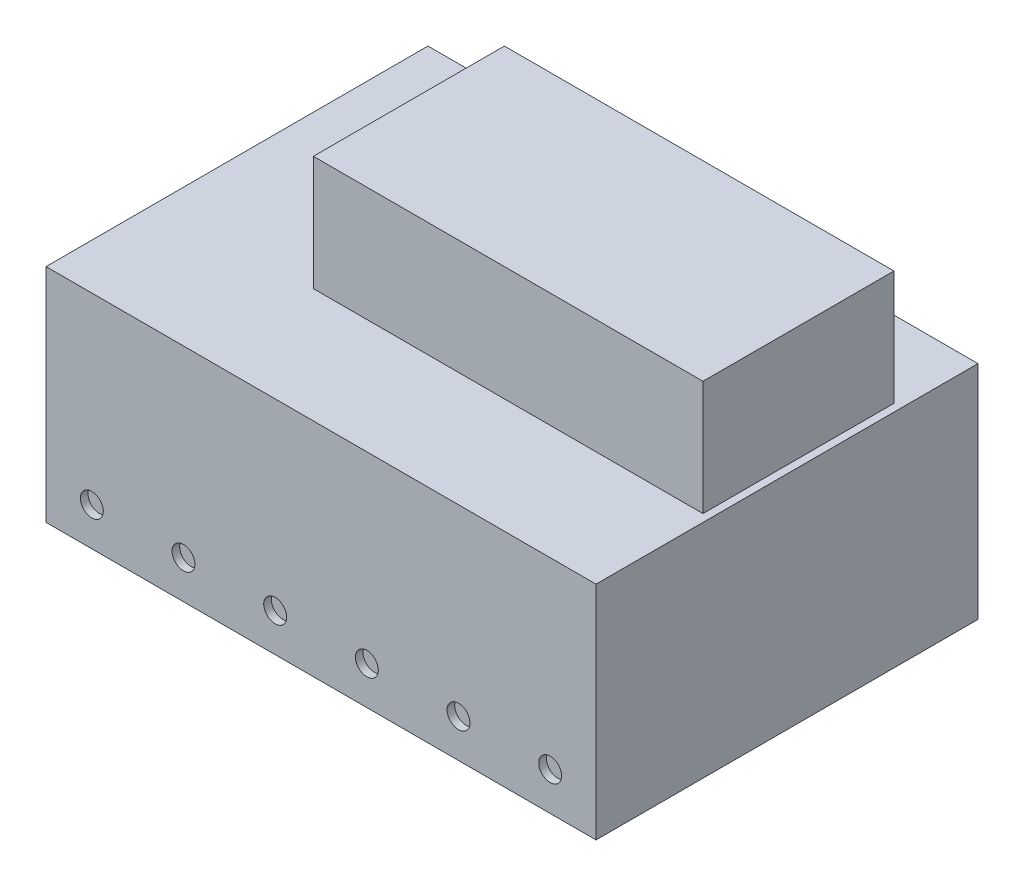
ISO-10303-21;
HEADER;
FILE_DESCRIPTION(('STEP AP214'),'2;1');
FILE_NAME('part.step','',(''),(''),'','','');
FILE_SCHEMA(('AUTOMOTIVE_DESIGN { 1 0 10303 214 1 1 1 1 }'));
ENDSEC;
DATA;
#1=APPLICATION_CONTEXT('core data for automotive mechanical design processes');
#2=APPLICATION_PROTOCOL_DEFINITION('international standard','automotive_design',2000,#1);
#3=PRODUCT_CONTEXT('',#1,'mechanical');
#4=PRODUCT('Part','Part','',(#3));
#5=PRODUCT_RELATED_PRODUCT_CATEGORY('part','',(#4));
#6=PRODUCT_DEFINITION_FORMATION('','',#4);
#7=PRODUCT_DEFINITION_CONTEXT('part definition',#1,'design');
#8=PRODUCT_DEFINITION('design','',#6,#7);
#9=PRODUCT_DEFINITION_SHAPE('','',#8);
#10=(LENGTH_UNIT() NAMED_UNIT(*) SI_UNIT(.MILLI.,.METRE.));
#11=(NAMED_UNIT(*) PLANE_ANGLE_UNIT() SI_UNIT($,.RADIAN.));
#12=(NAMED_UNIT(*) SI_UNIT($,.STERADIAN.) SOLID_ANGLE_UNIT());
#13=UNCERTAINTY_MEASURE_WITH_UNIT(LENGTH_MEASURE(1.E-05),#10,'distance_accuracy_value','');
#14=(GEOMETRIC_REPRESENTATION_CONTEXT(3) GLOBAL_UNCERTAINTY_ASSIGNED_CONTEXT((#13)) GLOBAL_UNIT_ASSIGNED_CONTEXT((#10,
#11,#12)) REPRESENTATION_CONTEXT('',''));
#15=CARTESIAN_POINT('',(0.,0.,0.));
#16=DIRECTION('',(0.,0.,1.));
#17=DIRECTION('',(1.,0.,0.));
#18=AXIS2_PLACEMENT_3D('',#15,#16,#17);
#19=CARTESIAN_POINT('',(-36.,14.5,50.));
#20=DIRECTION('',(0.,-1.,0.));
#21=DIRECTION('',(0.,0.,-1.));
#22=AXIS2_PLACEMENT_3D('',#19,#20,#21);
#23=PLANE('',#22);
#24=CARTESIAN_POINT('',(26.,14.5,5.));
#25=DIRECTION('',(0.,-1.,0.));
#26=DIRECTION('',(0.,0.,-1.));
#27=AXIS2_PLACEMENT_3D('',#24,#25,#26);
#28=CIRCLE('',#27,2.5);
#29=CARTESIAN_POINT('',(26.,14.5,2.5));
#30=VERTEX_POINT('',#29);
#31=EDGE_CURVE('E283',#30,#30,#28,.F.);
#32=ORIENTED_EDGE('',*,*,#31,.F.);
#33=EDGE_LOOP('',(#32));
#34=FACE_BOUND('',#33,.T.);
#35=CARTESIAN_POINT('',(-26.,14.5,5.));
#36=DIRECTION('',(0.,-1.,0.));
#37=DIRECTION('',(0.,0.,-1.));
#38=AXIS2_PLACEMENT_3D('',#35,#36,#37);
#39=CIRCLE('',#38,2.5);
#40=CARTESIAN_POINT('',(-26.,14.5,2.5));
#41=VERTEX_POINT('',#40);
#42=EDGE_CURVE('E290',#41,#41,#39,.F.);
#43=ORIENTED_EDGE('',*,*,#42,.F.);
#44=EDGE_LOOP('',(#43));
#45=FACE_BOUND('',#44,.T.);
#46=DIRECTION('',(-1.,0.,0.));
#47=VECTOR('',#46,1.);
#48=CARTESIAN_POINT('',(-36.,14.5,0.));
#49=LINE('',#48,#47);
#50=CARTESIAN_POINT('',(36.,14.5,0.));
#51=VERTEX_POINT('',#50);
#52=CARTESIAN_POINT('',(-36.,14.5,0.));
#53=VERTEX_POINT('',#52);
#54=EDGE_CURVE('E133',#51,#53,#49,.T.);
#55=ORIENTED_EDGE('',*,*,#54,.T.);
#56=DIRECTION('',(0.,0.,-1.));
#57=VECTOR('',#56,1.);
#58=CARTESIAN_POINT('',(-36.,14.5,50.));
#59=LINE('',#58,#57);
#60=CARTESIAN_POINT('',(-36.,14.5,50.));
#61=VERTEX_POINT('',#60);
#62=EDGE_CURVE('E48',#61,#53,#59,.T.);
#63=ORIENTED_EDGE('',*,*,#62,.F.);
#64=DIRECTION('',(-1.,0.,0.));
#65=VECTOR('',#64,1.);
#66=CARTESIAN_POINT('',(-36.,14.5,50.));
#67=LINE('',#66,#65);
#68=CARTESIAN_POINT('',(36.,14.5,50.));
#69=VERTEX_POINT('',#68);
#70=EDGE_CURVE('E143',#69,#61,#67,.T.);
#71=ORIENTED_EDGE('',*,*,#70,.F.);
#72=DIRECTION('',(0.,0.,-1.));
#73=VECTOR('',#72,1.);
#74=CARTESIAN_POINT('',(36.,14.5,50.));
#75=LINE('',#74,#73);
#76=EDGE_CURVE('E11',#69,#51,#75,.T.);
#77=ORIENTED_EDGE('',*,*,#76,.T.);
#78=EDGE_LOOP('',(#55,#63,#71,#77));
#79=FACE_BOUND('',#78,.T.);
#80=DIRECTION('',(0.,0.,1.));
#81=VECTOR('',#80,1.);
#82=CARTESIAN_POINT('',(-16.,14.5,10.));
#83=LINE('',#82,#81);
#84=CARTESIAN_POINT('',(-16.,14.5,10.));
#85=VERTEX_POINT('',#84);
#86=CARTESIAN_POINT('',(-16.,14.5,35.));
#87=VERTEX_POINT('',#86);
#88=EDGE_CURVE('E55',#85,#87,#83,.T.);
#89=ORIENTED_EDGE('',*,*,#88,.F.);
#90=DIRECTION('',(-1.,0.,0.));
#91=VECTOR('',#90,1.);
#92=CARTESIAN_POINT('',(-16.,14.5,10.));
#93=LINE('',#92,#91);
#94=CARTESIAN_POINT('',(35.,14.5,10.));
#95=VERTEX_POINT('',#94);
#96=EDGE_CURVE('E59',#95,#85,#93,.T.);
#97=ORIENTED_EDGE('',*,*,#96,.F.);
#98=DIRECTION('',(0.,0.,-1.));
#99=VECTOR('',#98,1.);
#100=CARTESIAN_POINT('',(35.,14.5,10.));
#101=LINE('',#100,#99);
#102=CARTESIAN_POINT('',(35.,14.5,35.));
#103=VERTEX_POINT('',#102);
#104=EDGE_CURVE('E355',#103,#95,#101,.T.);
#105=ORIENTED_EDGE('',*,*,#104,.F.);
#106=DIRECTION('',(1.,0.,0.));
#107=VECTOR('',#106,1.);
#108=CARTESIAN_POINT('',(-16.,14.5,35.));
#109=LINE('',#108,#107);
#110=EDGE_CURVE('E352',#87,#103,#109,.T.);
#111=ORIENTED_EDGE('',*,*,#110,.F.);
#112=EDGE_LOOP('',(#89,#97,#105,#111));
#113=FACE_BOUND('',#112,.T.);
#114=ADVANCED_FACE('F39',(#34,#45,#79,#113),#23,.F.);
#115=CARTESIAN_POINT('',(36.,-14.5,50.));
#116=DIRECTION('',(-1.,0.,0.));
#117=DIRECTION('',(0.,0.,1.));
#118=AXIS2_PLACEMENT_3D('',#115,#116,#117);
#119=PLANE('',#118);
#120=DIRECTION('',(0.,1.,0.));
#121=VECTOR('',#120,1.);
#122=CARTESIAN_POINT('',(36.,-14.5,0.));
#123=LINE('',#122,#121);
#124=CARTESIAN_POINT('',(36.,-14.5,0.));
#125=VERTEX_POINT('',#124);
#126=EDGE_CURVE('E128',#125,#51,#123,.T.);
#127=ORIENTED_EDGE('',*,*,#126,.T.);
#128=ORIENTED_EDGE('',*,*,#76,.F.);
#129=DIRECTION('',(0.,1.,0.));
#130=VECTOR('',#129,1.);
#131=CARTESIAN_POINT('',(36.,-14.5,50.));
#132=LINE('',#131,#130);
#133=CARTESIAN_POINT('',(36.,-14.5,50.));
#134=VERTEX_POINT('',#133);
#135=EDGE_CURVE('E139',#134,#69,#132,.T.);
#136=ORIENTED_EDGE('',*,*,#135,.F.);
#137=DIRECTION('',(0.,0.,-1.));
#138=VECTOR('',#137,1.);
#139=CARTESIAN_POINT('',(36.,-14.5,50.));
#140=LINE('',#139,#138);
#141=EDGE_CURVE('E152',#134,#125,#140,.T.);
#142=ORIENTED_EDGE('',*,*,#141,.T.);
#143=EDGE_LOOP('',(#127,#128,#136,#142));
#144=FACE_BOUND('',#143,.T.);
#145=ADVANCED_FACE('F41',(#144),#119,.F.);
#146=CARTESIAN_POINT('',(-36.,-14.5,50.));
#147=DIRECTION('',(1.,0.,0.));
#148=DIRECTION('',(0.,0.,-1.));
#149=AXIS2_PLACEMENT_3D('',#146,#147,#148);
#150=PLANE('',#149);
#151=DIRECTION('',(0.,-1.,0.));
#152=VECTOR('',#151,1.);
#153=CARTESIAN_POINT('',(-36.,-14.5,0.));
#154=LINE('',#153,#152);
#155=CARTESIAN_POINT('',(-36.,-14.5,0.));
#156=VERTEX_POINT('',#155);
#157=EDGE_CURVE('E156',#53,#156,#154,.T.);
#158=ORIENTED_EDGE('',*,*,#157,.T.);
#159=DIRECTION('',(0.,0.,-1.));
#160=VECTOR('',#159,1.);
#161=CARTESIAN_POINT('',(-36.,-14.5,50.));
#162=LINE('',#161,#160);
#163=CARTESIAN_POINT('',(-36.,-14.5,50.));
#164=VERTEX_POINT('',#163);
#165=EDGE_CURVE('E164',#164,#156,#162,.T.);
#166=ORIENTED_EDGE('',*,*,#165,.F.);
#167=DIRECTION('',(0.,-1.,0.));
#168=VECTOR('',#167,1.);
#169=CARTESIAN_POINT('',(-36.,-14.5,50.));
#170=LINE('',#169,#168);
#171=EDGE_CURVE('E147',#61,#164,#170,.T.);
#172=ORIENTED_EDGE('',*,*,#171,.F.);
#173=ORIENTED_EDGE('',*,*,#62,.T.);
#174=EDGE_LOOP('',(#158,#166,#172,#173));
#175=FACE_BOUND('',#174,.T.);
#176=ADVANCED_FACE('F173',(#175),#150,.F.);
#177=CARTESIAN_POINT('',(-36.,-14.5,50.));
#178=DIRECTION('',(0.,1.,0.));
#179=DIRECTION('',(0.,0.,1.));
#180=AXIS2_PLACEMENT_3D('',#177,#178,#179);
#181=PLANE('',#180);
#182=CARTESIAN_POINT('',(26.,-14.5,5.));
#183=DIRECTION('',(0.,1.,0.));
#184=DIRECTION('',(0.,0.,1.));
#185=AXIS2_PLACEMENT_3D('',#182,#183,#184);
#186=CIRCLE('',#185,2.5);
#187=CARTESIAN_POINT('',(26.,-14.5,7.5));
#188=VERTEX_POINT('',#187);
#189=EDGE_CURVE('E281',#188,#188,#186,.F.);
#190=ORIENTED_EDGE('',*,*,#189,.F.);
#191=EDGE_LOOP('',(#190));
#192=FACE_BOUND('',#191,.T.);
#193=CARTESIAN_POINT('',(-26.,-14.5,5.));
#194=DIRECTION('',(0.,1.,0.));
#195=DIRECTION('',(0.,0.,1.));
#196=AXIS2_PLACEMENT_3D('',#193,#194,#195);
#197=CIRCLE('',#196,2.5);
#198=CARTESIAN_POINT('',(-26.,-14.5,7.5));
#199=VERTEX_POINT('',#198);
#200=EDGE_CURVE('E285',#199,#199,#197,.F.);
#201=ORIENTED_EDGE('',*,*,#200,.F.);
#202=EDGE_LOOP('',(#201));
#203=FACE_BOUND('',#202,.T.);
#204=DIRECTION('',(1.,0.,0.));
#205=VECTOR('',#204,1.);
#206=CARTESIAN_POINT('',(-36.,-14.5,0.));
#207=LINE('',#206,#205);
#208=EDGE_CURVE('E144',#156,#125,#207,.T.);
#209=ORIENTED_EDGE('',*,*,#208,.T.);
#210=ORIENTED_EDGE('',*,*,#141,.F.);
#211=DIRECTION('',(1.,0.,0.));
#212=VECTOR('',#211,1.);
#213=CARTESIAN_POINT('',(-36.,-14.5,50.));
#214=LINE('',#213,#212);
#215=EDGE_CURVE('E150',#164,#134,#214,.T.);
#216=ORIENTED_EDGE('',*,*,#215,.F.);
#217=ORIENTED_EDGE('',*,*,#165,.T.);
#218=EDGE_LOOP('',(#209,#210,#216,#217));
#219=FACE_BOUND('',#218,.T.);
#220=ADVANCED_FACE('F182',(#192,#203,#219),#181,.F.);
#221=CARTESIAN_POINT('',(0.,0.,50.));
#222=DIRECTION('',(0.,0.,-1.));
#223=DIRECTION('',(-1.,0.,0.));
#224=AXIS2_PLACEMENT_3D('',#221,#222,#223);
#225=PLANE('',#224);
#226=CARTESIAN_POINT('',(-30.,-9.5,50.));
#227=DIRECTION('',(0.,0.,1.));
#228=DIRECTION('',(1.,0.,0.));
#229=AXIS2_PLACEMENT_3D('',#226,#227,#228);
#230=CIRCLE('',#229,1.5);
#231=CARTESIAN_POINT('',(-28.5,-9.5,50.));
#232=VERTEX_POINT('',#231);
#233=EDGE_CURVE('E302',#232,#232,#230,.T.);
#234=ORIENTED_EDGE('',*,*,#233,.F.);
#235=EDGE_LOOP('',(#234));
#236=FACE_BOUND('',#235,.T.);
#237=CARTESIAN_POINT('',(-18.,-9.5,50.));
#238=DIRECTION('',(0.,0.,1.));
#239=DIRECTION('',(1.,0.,0.));
#240=AXIS2_PLACEMENT_3D('',#237,#238,#239);
#241=CIRCLE('',#240,1.5);
#242=CARTESIAN_POINT('',(-16.5,-9.5,50.));
#243=VERTEX_POINT('',#242);
#244=EDGE_CURVE('E310',#243,#243,#241,.T.);
#245=ORIENTED_EDGE('',*,*,#244,.F.);
#246=EDGE_LOOP('',(#245));
#247=FACE_BOUND('',#246,.T.);
#248=CARTESIAN_POINT('',(-6.,-9.5,50.));
#249=DIRECTION('',(0.,0.,1.));
#250=DIRECTION('',(1.,0.,0.));
#251=AXIS2_PLACEMENT_3D('',#248,#249,#250);
#252=CIRCLE('',#251,1.5);
#253=CARTESIAN_POINT('',(-4.5,-9.5,50.));
#254=VERTEX_POINT('',#253);
#255=EDGE_CURVE('E318',#254,#254,#252,.T.);
#256=ORIENTED_EDGE('',*,*,#255,.F.);
#257=EDGE_LOOP('',(#256));
#258=FACE_BOUND('',#257,.T.);
#259=CARTESIAN_POINT('',(6.,-9.5,50.));
#260=DIRECTION('',(0.,0.,1.));
#261=DIRECTION('',(1.,0.,0.));
#262=AXIS2_PLACEMENT_3D('',#259,#260,#261);
#263=CIRCLE('',#262,1.5);
#264=CARTESIAN_POINT('',(7.5,-9.5,50.));
#265=VERTEX_POINT('',#264);
#266=EDGE_CURVE('E326',#265,#265,#263,.T.);
#267=ORIENTED_EDGE('',*,*,#266,.F.);
#268=EDGE_LOOP('',(#267));
#269=FACE_BOUND('',#268,.T.);
#270=CARTESIAN_POINT('',(18.,-9.5,50.));
#271=DIRECTION('',(0.,0.,1.));
#272=DIRECTION('',(1.,0.,0.));
#273=AXIS2_PLACEMENT_3D('',#270,#271,#272);
#274=CIRCLE('',#273,1.5);
#275=CARTESIAN_POINT('',(19.5,-9.5,50.));
#276=VERTEX_POINT('',#275);
#277=EDGE_CURVE('E334',#276,#276,#274,.T.);
#278=ORIENTED_EDGE('',*,*,#277,.F.);
#279=EDGE_LOOP('',(#278));
#280=FACE_BOUND('',#279,.T.);
#281=CARTESIAN_POINT('',(30.,-9.5,50.));
#282=DIRECTION('',(0.,0.,1.));
#283=DIRECTION('',(1.,0.,0.));
#284=AXIS2_PLACEMENT_3D('',#281,#282,#283);
#285=CIRCLE('',#284,1.5);
#286=CARTESIAN_POINT('',(31.5,-9.5,50.));
#287=VERTEX_POINT('',#286);
#288=EDGE_CURVE('E297',#287,#287,#285,.T.);
#289=ORIENTED_EDGE('',*,*,#288,.F.);
#290=EDGE_LOOP('',(#289));
#291=FACE_BOUND('',#290,.T.);
#292=ORIENTED_EDGE('',*,*,#135,.T.);
#293=ORIENTED_EDGE('',*,*,#70,.T.);
#294=ORIENTED_EDGE('',*,*,#171,.T.);
#295=ORIENTED_EDGE('',*,*,#215,.T.);
#296=EDGE_LOOP('',(#292,#293,#294,#295));
#297=FACE_BOUND('',#296,.T.);
#298=ADVANCED_FACE('F188',(#236,#247,#258,#269,#280,#291,#297),#225,.F.);
#299=CARTESIAN_POINT('',(0.,0.,0.));
#300=DIRECTION('',(0.,0.,-1.));
#301=DIRECTION('',(-1.,0.,0.));
#302=AXIS2_PLACEMENT_3D('',#299,#300,#301);
#303=PLANE('',#302);
#304=ORIENTED_EDGE('',*,*,#126,.F.);
#305=ORIENTED_EDGE('',*,*,#208,.F.);
#306=ORIENTED_EDGE('',*,*,#157,.F.);
#307=ORIENTED_EDGE('',*,*,#54,.F.);
#308=EDGE_LOOP('',(#304,#305,#306,#307));
#309=FACE_BOUND('',#308,.T.);
#310=ADVANCED_FACE('F179',(#309),#303,.T.);
#311=CARTESIAN_POINT('',(-16.,29.5,10.));
#312=DIRECTION('',(1.,0.,0.));
#313=DIRECTION('',(0.,0.,-1.));
#314=AXIS2_PLACEMENT_3D('',#311,#312,#313);
#315=PLANE('',#314);
#316=ORIENTED_EDGE('',*,*,#88,.T.);
#317=DIRECTION('',(0.,-1.,0.));
#318=VECTOR('',#317,1.);
#319=CARTESIAN_POINT('',(-16.,29.5,35.));
#320=LINE('',#319,#318);
#321=CARTESIAN_POINT('',(-16.,29.5,35.));
#322=VERTEX_POINT('',#321);
#323=EDGE_CURVE('E108',#322,#87,#320,.T.);
#324=ORIENTED_EDGE('',*,*,#323,.F.);
#325=DIRECTION('',(0.,0.,1.));
#326=VECTOR('',#325,1.);
#327=CARTESIAN_POINT('',(-16.,29.5,10.));
#328=LINE('',#327,#326);
#329=CARTESIAN_POINT('',(-16.,29.5,10.));
#330=VERTEX_POINT('',#329);
#331=EDGE_CURVE('E115',#330,#322,#328,.T.);
#332=ORIENTED_EDGE('',*,*,#331,.F.);
#333=DIRECTION('',(0.,-1.,0.));
#334=VECTOR('',#333,1.);
#335=CARTESIAN_POINT('',(-16.,29.5,10.));
#336=LINE('',#335,#334);
#337=EDGE_CURVE('E349',#330,#85,#336,.T.);
#338=ORIENTED_EDGE('',*,*,#337,.T.);
#339=EDGE_LOOP('',(#316,#324,#332,#338));
#340=FACE_BOUND('',#339,.T.);
#341=ADVANCED_FACE('F126',(#340),#315,.F.);
#342=CARTESIAN_POINT('',(-16.,29.5,35.));
#343=DIRECTION('',(0.,0.,-1.));
#344=DIRECTION('',(-1.,0.,0.));
#345=AXIS2_PLACEMENT_3D('',#342,#343,#344);
#346=PLANE('',#345);
#347=ORIENTED_EDGE('',*,*,#110,.T.);
#348=DIRECTION('',(0.,-1.,0.));
#349=VECTOR('',#348,1.);
#350=CARTESIAN_POINT('',(35.,29.5,35.));
#351=LINE('',#350,#349);
#352=CARTESIAN_POINT('',(35.,29.5,35.));
#353=VERTEX_POINT('',#352);
#354=EDGE_CURVE('E110',#353,#103,#351,.T.);
#355=ORIENTED_EDGE('',*,*,#354,.F.);
#356=DIRECTION('',(1.,0.,0.));
#357=VECTOR('',#356,1.);
#358=CARTESIAN_POINT('',(-16.,29.5,35.));
#359=LINE('',#358,#357);
#360=EDGE_CURVE('E103',#322,#353,#359,.T.);
#361=ORIENTED_EDGE('',*,*,#360,.F.);
#362=ORIENTED_EDGE('',*,*,#323,.T.);
#363=EDGE_LOOP('',(#347,#355,#361,#362));
#364=FACE_BOUND('',#363,.T.);
#365=ADVANCED_FACE('F106',(#364),#346,.F.);
#366=CARTESIAN_POINT('',(35.,29.5,10.));
#367=DIRECTION('',(-1.,0.,0.));
#368=DIRECTION('',(0.,0.,1.));
#369=AXIS2_PLACEMENT_3D('',#366,#367,#368);
#370=PLANE('',#369);
#371=ORIENTED_EDGE('',*,*,#104,.T.);
#372=DIRECTION('',(0.,-1.,0.));
#373=VECTOR('',#372,1.);
#374=CARTESIAN_POINT('',(35.,29.5,10.));
#375=LINE('',#374,#373);
#376=CARTESIAN_POINT('',(35.,29.5,10.));
#377=VERTEX_POINT('',#376);
#378=EDGE_CURVE('E135',#377,#95,#375,.T.);
#379=ORIENTED_EDGE('',*,*,#378,.F.);
#380=DIRECTION('',(0.,0.,-1.));
#381=VECTOR('',#380,1.);
#382=CARTESIAN_POINT('',(35.,29.5,10.));
#383=LINE('',#382,#381);
#384=EDGE_CURVE('E114',#353,#377,#383,.T.);
#385=ORIENTED_EDGE('',*,*,#384,.F.);
#386=ORIENTED_EDGE('',*,*,#354,.T.);
#387=EDGE_LOOP('',(#371,#379,#385,#386));
#388=FACE_BOUND('',#387,.T.);
#389=ADVANCED_FACE('F211',(#388),#370,.F.);
#390=CARTESIAN_POINT('',(-16.,29.5,10.));
#391=DIRECTION('',(0.,0.,1.));
#392=DIRECTION('',(1.,0.,0.));
#393=AXIS2_PLACEMENT_3D('',#390,#391,#392);
#394=PLANE('',#393);
#395=ORIENTED_EDGE('',*,*,#96,.T.);
#396=ORIENTED_EDGE('',*,*,#337,.F.);
#397=DIRECTION('',(-1.,0.,0.));
#398=VECTOR('',#397,1.);
#399=CARTESIAN_POINT('',(-16.,29.5,10.));
#400=LINE('',#399,#398);
#401=EDGE_CURVE('E120',#377,#330,#400,.T.);
#402=ORIENTED_EDGE('',*,*,#401,.F.);
#403=ORIENTED_EDGE('',*,*,#378,.T.);
#404=EDGE_LOOP('',(#395,#396,#402,#403));
#405=FACE_BOUND('',#404,.T.);
#406=ADVANCED_FACE('F214',(#405),#394,.F.);
#407=CARTESIAN_POINT('',(0.,29.5,0.));
#408=DIRECTION('',(0.,1.,0.));
#409=DIRECTION('',(0.,0.,1.));
#410=AXIS2_PLACEMENT_3D('',#407,#408,#409);
#411=PLANE('',#410);
#412=ORIENTED_EDGE('',*,*,#331,.T.);
#413=ORIENTED_EDGE('',*,*,#360,.T.);
#414=ORIENTED_EDGE('',*,*,#384,.T.);
#415=ORIENTED_EDGE('',*,*,#401,.T.);
#416=EDGE_LOOP('',(#412,#413,#414,#415));
#417=FACE_BOUND('',#416,.T.);
#418=ADVANCED_FACE('F118',(#417),#411,.T.);
#419=CARTESIAN_POINT('',(30.,-9.5,49.));
#420=DIRECTION('',(0.,0.,1.));
#421=DIRECTION('',(1.,0.,0.));
#422=AXIS2_PLACEMENT_3D('',#419,#420,#421);
#423=CYLINDRICAL_SURFACE('',#422,1.5);
#424=CARTESIAN_POINT('',(30.,-9.5,49.));
#425=DIRECTION('',(0.,0.,1.));
#426=DIRECTION('',(1.,0.,0.));
#427=AXIS2_PLACEMENT_3D('',#424,#425,#426);
#428=CIRCLE('',#427,1.5);
#429=CARTESIAN_POINT('',(31.5,-9.5,49.));
#430=VERTEX_POINT('',#429);
#431=EDGE_CURVE('E338',#430,#430,#428,.T.);
#432=ORIENTED_EDGE('',*,*,#431,.F.);
#433=EDGE_LOOP('',(#432));
#434=FACE_BOUND('',#433,.T.);
#435=ORIENTED_EDGE('',*,*,#288,.T.);
#436=EDGE_LOOP('',(#435));
#437=FACE_BOUND('',#436,.T.);
#438=ADVANCED_FACE('F221',(#434,#437),#423,.F.);
#439=CARTESIAN_POINT('',(30.,-9.5,49.));
#440=DIRECTION('',(0.,0.,1.));
#441=DIRECTION('',(1.,0.,0.));
#442=AXIS2_PLACEMENT_3D('',#439,#440,#441);
#443=PLANE('',#442);
#444=ORIENTED_EDGE('',*,*,#431,.T.);
#445=EDGE_LOOP('',(#444));
#446=FACE_BOUND('',#445,.T.);
#447=ADVANCED_FACE('F224',(#446),#443,.T.);
#448=CARTESIAN_POINT('',(18.,-9.5,49.));
#449=DIRECTION('',(0.,0.,1.));
#450=DIRECTION('',(1.,0.,0.));
#451=AXIS2_PLACEMENT_3D('',#448,#449,#450);
#452=CYLINDRICAL_SURFACE('',#451,1.5);
#453=CARTESIAN_POINT('',(18.,-9.5,49.));
#454=DIRECTION('',(0.,0.,1.));
#455=DIRECTION('',(1.,0.,0.));
#456=AXIS2_PLACEMENT_3D('',#453,#454,#455);
#457=CIRCLE('',#456,1.5);
#458=CARTESIAN_POINT('',(19.5,-9.5,49.));
#459=VERTEX_POINT('',#458);
#460=EDGE_CURVE('E330',#459,#459,#457,.T.);
#461=ORIENTED_EDGE('',*,*,#460,.F.);
#462=EDGE_LOOP('',(#461));
#463=FACE_BOUND('',#462,.T.);
#464=ORIENTED_EDGE('',*,*,#277,.T.);
#465=EDGE_LOOP('',(#464));
#466=FACE_BOUND('',#465,.T.);
#467=ADVANCED_FACE('F228',(#463,#466),#452,.F.);
#468=CARTESIAN_POINT('',(18.,-9.5,49.));
#469=DIRECTION('',(0.,0.,1.));
#470=DIRECTION('',(1.,0.,0.));
#471=AXIS2_PLACEMENT_3D('',#468,#469,#470);
#472=PLANE('',#471);
#473=ORIENTED_EDGE('',*,*,#460,.T.);
#474=EDGE_LOOP('',(#473));
#475=FACE_BOUND('',#474,.T.);
#476=ADVANCED_FACE('F232',(#475),#472,.T.);
#477=CARTESIAN_POINT('',(6.,-9.5,49.));
#478=DIRECTION('',(0.,0.,1.));
#479=DIRECTION('',(1.,0.,0.));
#480=AXIS2_PLACEMENT_3D('',#477,#478,#479);
#481=CYLINDRICAL_SURFACE('',#480,1.5);
#482=CARTESIAN_POINT('',(6.,-9.5,49.));
#483=DIRECTION('',(0.,0.,1.));
#484=DIRECTION('',(1.,0.,0.));
#485=AXIS2_PLACEMENT_3D('',#482,#483,#484);
#486=CIRCLE('',#485,1.5);
#487=CARTESIAN_POINT('',(7.5,-9.5,49.));
#488=VERTEX_POINT('',#487);
#489=EDGE_CURVE('E322',#488,#488,#486,.T.);
#490=ORIENTED_EDGE('',*,*,#489,.F.);
#491=EDGE_LOOP('',(#490));
#492=FACE_BOUND('',#491,.T.);
#493=ORIENTED_EDGE('',*,*,#266,.T.);
#494=EDGE_LOOP('',(#493));
#495=FACE_BOUND('',#494,.T.);
#496=ADVANCED_FACE('F236',(#492,#495),#481,.F.);
#497=CARTESIAN_POINT('',(6.,-9.5,49.));
#498=DIRECTION('',(0.,0.,1.));
#499=DIRECTION('',(1.,0.,0.));
#500=AXIS2_PLACEMENT_3D('',#497,#498,#499);
#501=PLANE('',#500);
#502=ORIENTED_EDGE('',*,*,#489,.T.);
#503=EDGE_LOOP('',(#502));
#504=FACE_BOUND('',#503,.T.);
#505=ADVANCED_FACE('F240',(#504),#501,.T.);
#506=CARTESIAN_POINT('',(-6.,-9.5,49.));
#507=DIRECTION('',(0.,0.,1.));
#508=DIRECTION('',(1.,0.,0.));
#509=AXIS2_PLACEMENT_3D('',#506,#507,#508);
#510=CYLINDRICAL_SURFACE('',#509,1.5);
#511=CARTESIAN_POINT('',(-6.,-9.5,49.));
#512=DIRECTION('',(0.,0.,1.));
#513=DIRECTION('',(1.,0.,0.));
#514=AXIS2_PLACEMENT_3D('',#511,#512,#513);
#515=CIRCLE('',#514,1.5);
#516=CARTESIAN_POINT('',(-4.5,-9.5,49.));
#517=VERTEX_POINT('',#516);
#518=EDGE_CURVE('E314',#517,#517,#515,.T.);
#519=ORIENTED_EDGE('',*,*,#518,.F.);
#520=EDGE_LOOP('',(#519));
#521=FACE_BOUND('',#520,.T.);
#522=ORIENTED_EDGE('',*,*,#255,.T.);
#523=EDGE_LOOP('',(#522));
#524=FACE_BOUND('',#523,.T.);
#525=ADVANCED_FACE('F244',(#521,#524),#510,.F.);
#526=CARTESIAN_POINT('',(-6.,-9.5,49.));
#527=DIRECTION('',(0.,0.,1.));
#528=DIRECTION('',(1.,0.,0.));
#529=AXIS2_PLACEMENT_3D('',#526,#527,#528);
#530=PLANE('',#529);
#531=ORIENTED_EDGE('',*,*,#518,.T.);
#532=EDGE_LOOP('',(#531));
#533=FACE_BOUND('',#532,.T.);
#534=ADVANCED_FACE('F248',(#533),#530,.T.);
#535=CARTESIAN_POINT('',(-18.,-9.5,49.));
#536=DIRECTION('',(0.,0.,1.));
#537=DIRECTION('',(1.,0.,0.));
#538=AXIS2_PLACEMENT_3D('',#535,#536,#537);
#539=CYLINDRICAL_SURFACE('',#538,1.5);
#540=CARTESIAN_POINT('',(-18.,-9.5,49.));
#541=DIRECTION('',(0.,0.,1.));
#542=DIRECTION('',(1.,0.,0.));
#543=AXIS2_PLACEMENT_3D('',#540,#541,#542);
#544=CIRCLE('',#543,1.5);
#545=CARTESIAN_POINT('',(-16.5,-9.5,49.));
#546=VERTEX_POINT('',#545);
#547=EDGE_CURVE('E306',#546,#546,#544,.T.);
#548=ORIENTED_EDGE('',*,*,#547,.F.);
#549=EDGE_LOOP('',(#548));
#550=FACE_BOUND('',#549,.T.);
#551=ORIENTED_EDGE('',*,*,#244,.T.);
#552=EDGE_LOOP('',(#551));
#553=FACE_BOUND('',#552,.T.);
#554=ADVANCED_FACE('F252',(#550,#553),#539,.F.);
#555=CARTESIAN_POINT('',(-18.,-9.5,49.));
#556=DIRECTION('',(0.,0.,1.));
#557=DIRECTION('',(1.,0.,0.));
#558=AXIS2_PLACEMENT_3D('',#555,#556,#557);
#559=PLANE('',#558);
#560=ORIENTED_EDGE('',*,*,#547,.T.);
#561=EDGE_LOOP('',(#560));
#562=FACE_BOUND('',#561,.T.);
#563=ADVANCED_FACE('F256',(#562),#559,.T.);
#564=CARTESIAN_POINT('',(-30.,-9.5,49.));
#565=DIRECTION('',(0.,0.,1.));
#566=DIRECTION('',(1.,0.,0.));
#567=AXIS2_PLACEMENT_3D('',#564,#565,#566);
#568=CYLINDRICAL_SURFACE('',#567,1.5);
#569=CARTESIAN_POINT('',(-30.,-9.5,49.));
#570=DIRECTION('',(0.,0.,1.));
#571=DIRECTION('',(1.,0.,0.));
#572=AXIS2_PLACEMENT_3D('',#569,#570,#571);
#573=CIRCLE('',#572,1.5);
#574=CARTESIAN_POINT('',(-28.5,-9.5,49.));
#575=VERTEX_POINT('',#574);
#576=EDGE_CURVE('E298',#575,#575,#573,.T.);
#577=ORIENTED_EDGE('',*,*,#576,.F.);
#578=EDGE_LOOP('',(#577));
#579=FACE_BOUND('',#578,.T.);
#580=ORIENTED_EDGE('',*,*,#233,.T.);
#581=EDGE_LOOP('',(#580));
#582=FACE_BOUND('',#581,.T.);
#583=ADVANCED_FACE('F260',(#579,#582),#568,.F.);
#584=CARTESIAN_POINT('',(-30.,-9.5,49.));
#585=DIRECTION('',(0.,0.,1.));
#586=DIRECTION('',(1.,0.,0.));
#587=AXIS2_PLACEMENT_3D('',#584,#585,#586);
#588=PLANE('',#587);
#589=ORIENTED_EDGE('',*,*,#576,.T.);
#590=EDGE_LOOP('',(#589));
#591=FACE_BOUND('',#590,.T.);
#592=ADVANCED_FACE('F264',(#591),#588,.T.);
#593=CARTESIAN_POINT('',(-26.,54.5,5.));
#594=DIRECTION('',(0.,-1.,0.));
#595=DIRECTION('',(0.,0.,-1.));
#596=AXIS2_PLACEMENT_3D('',#593,#594,#595);
#597=CYLINDRICAL_SURFACE('',#596,2.5);
#598=ORIENTED_EDGE('',*,*,#200,.T.);
#599=EDGE_LOOP('',(#598));
#600=FACE_BOUND('',#599,.T.);
#601=ORIENTED_EDGE('',*,*,#42,.T.);
#602=EDGE_LOOP('',(#601));
#603=FACE_BOUND('',#602,.T.);
#604=ADVANCED_FACE('F268',(#600,#603),#597,.F.);
#605=CARTESIAN_POINT('',(26.,54.5,5.));
#606=DIRECTION('',(0.,-1.,0.));
#607=DIRECTION('',(0.,0.,-1.));
#608=AXIS2_PLACEMENT_3D('',#605,#606,#607);
#609=CYLINDRICAL_SURFACE('',#608,2.5);
#610=ORIENTED_EDGE('',*,*,#189,.T.);
#611=EDGE_LOOP('',(#610));
#612=FACE_BOUND('',#611,.T.);
#613=ORIENTED_EDGE('',*,*,#31,.T.);
#614=EDGE_LOOP('',(#613));
#615=FACE_BOUND('',#614,.T.);
#616=ADVANCED_FACE('F272',(#612,#615),#609,.F.);
#617=CLOSED_SHELL('',(#114,#145,#176,#220,#298,#310,#341,#365,#389,#406,#418,#438,#447,#467,
#476,#496,#505,#525,#534,#554,#563,#583,#592,#604,#616));
#618=MANIFOLD_SOLID_BREP('B2',#617);
#619=ADVANCED_BREP_SHAPE_REPRESENTATION('',(#18,#618),#14);
#620=SHAPE_DEFINITION_REPRESENTATION(#9,#619);
ENDSEC;
END-ISO-10303-21;
